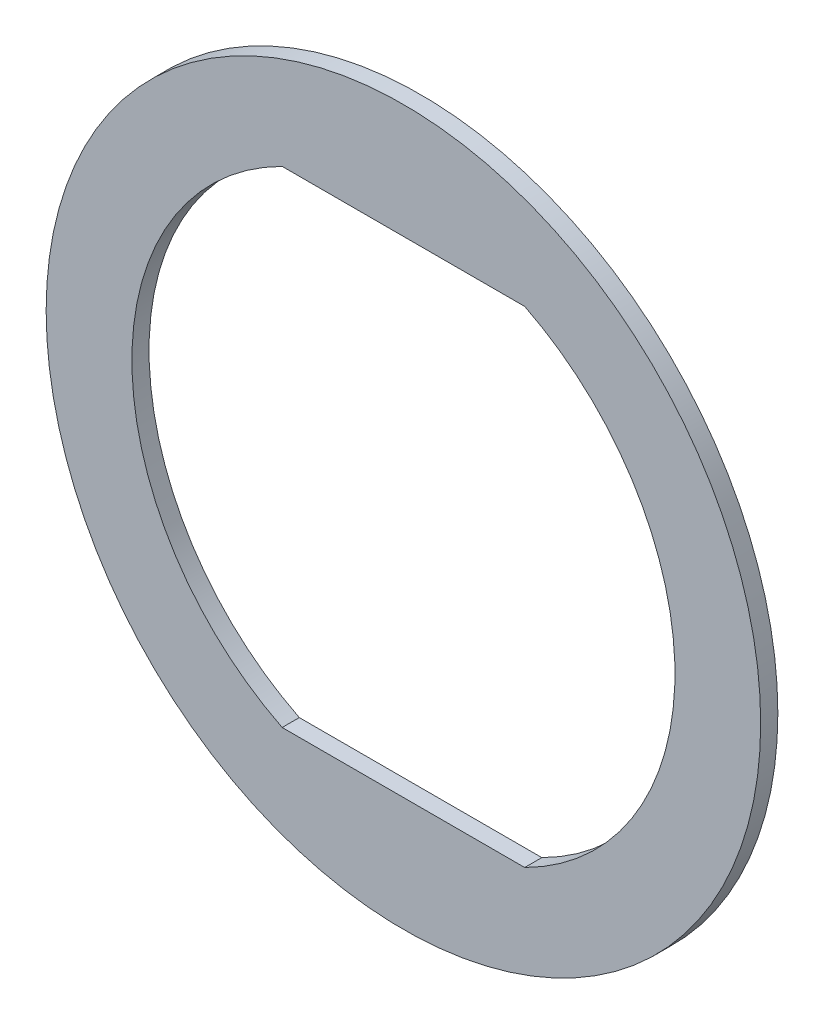
ISO-10303-21;
HEADER;
FILE_DESCRIPTION(('STEP AP214'),'2;1');
FILE_NAME('part.step','',(''),(''),'','','');
FILE_SCHEMA(('AUTOMOTIVE_DESIGN { 1 0 10303 214 1 1 1 1 }'));
ENDSEC;
DATA;
#1=APPLICATION_CONTEXT('core data for automotive mechanical design processes');
#2=APPLICATION_PROTOCOL_DEFINITION('international standard','automotive_design',2000,#1);
#3=PRODUCT_CONTEXT('',#1,'mechanical');
#4=PRODUCT('Part','Part','',(#3));
#5=PRODUCT_RELATED_PRODUCT_CATEGORY('part','',(#4));
#6=PRODUCT_DEFINITION_FORMATION('','',#4);
#7=PRODUCT_DEFINITION_CONTEXT('part definition',#1,'design');
#8=PRODUCT_DEFINITION('design','',#6,#7);
#9=PRODUCT_DEFINITION_SHAPE('','',#8);
#10=(LENGTH_UNIT() NAMED_UNIT(*) SI_UNIT(.MILLI.,.METRE.));
#11=(NAMED_UNIT(*) PLANE_ANGLE_UNIT() SI_UNIT($,.RADIAN.));
#12=(NAMED_UNIT(*) SI_UNIT($,.STERADIAN.) SOLID_ANGLE_UNIT());
#13=UNCERTAINTY_MEASURE_WITH_UNIT(LENGTH_MEASURE(1.E-05),#10,'distance_accuracy_value','');
#14=(GEOMETRIC_REPRESENTATION_CONTEXT(3) GLOBAL_UNCERTAINTY_ASSIGNED_CONTEXT((#13)) GLOBAL_UNIT_ASSIGNED_CONTEXT((#10,
#11,#12)) REPRESENTATION_CONTEXT('',''));
#15=CARTESIAN_POINT('',(0.,0.,0.));
#16=DIRECTION('',(0.,0.,1.));
#17=DIRECTION('',(1.,0.,0.));
#18=AXIS2_PLACEMENT_3D('',#15,#16,#17);
#19=CARTESIAN_POINT('',(0.,0.,0.3));
#20=DIRECTION('',(0.,0.,1.));
#21=DIRECTION('',(1.,0.,0.));
#22=AXIS2_PLACEMENT_3D('',#19,#20,#21);
#23=PLANE('',#22);
#24=CARTESIAN_POINT('',(0.,0.,0.3));
#25=DIRECTION('',(0.,0.,1.));
#26=DIRECTION('',(1.,0.,0.));
#27=AXIS2_PLACEMENT_3D('',#24,#25,#26);
#28=CIRCLE('',#27,12.5);
#29=CARTESIAN_POINT('',(12.5,0.,0.3));
#30=VERTEX_POINT('',#29);
#31=EDGE_CURVE('E11',#30,#30,#28,.T.);
#32=ORIENTED_EDGE('',*,*,#31,.T.);
#33=EDGE_LOOP('',(#32));
#34=FACE_BOUND('',#33,.T.);
#35=DIRECTION('',(1.,0.,0.));
#36=VECTOR('',#35,1.);
#37=CARTESIAN_POINT('',(4.24264068711928,-8.5,0.3));
#38=LINE('',#37,#36);
#39=CARTESIAN_POINT('',(-4.24264068711928,-8.5,0.3));
#40=VERTEX_POINT('',#39);
#41=CARTESIAN_POINT('',(4.24264068711928,-8.5,0.3));
#42=VERTEX_POINT('',#41);
#43=EDGE_CURVE('E82',#40,#42,#38,.T.);
#44=ORIENTED_EDGE('',*,*,#43,.F.);
#45=CARTESIAN_POINT('',(0.,0.,0.3));
#46=DIRECTION('',(0.,0.,1.));
#47=DIRECTION('',(1.,0.,0.));
#48=AXIS2_PLACEMENT_3D('',#45,#46,#47);
#49=CIRCLE('',#48,9.5);
#50=CARTESIAN_POINT('',(-4.24264068711929,8.5,0.3));
#51=VERTEX_POINT('',#50);
#52=EDGE_CURVE('E74',#51,#40,#49,.T.);
#53=ORIENTED_EDGE('',*,*,#52,.F.);
#54=DIRECTION('',(-1.,0.,0.));
#55=VECTOR('',#54,1.);
#56=CARTESIAN_POINT('',(-4.24264068711929,8.5,0.3));
#57=LINE('',#56,#55);
#58=CARTESIAN_POINT('',(4.24264068711928,8.5,0.3));
#59=VERTEX_POINT('',#58);
#60=EDGE_CURVE('E95',#59,#51,#57,.T.);
#61=ORIENTED_EDGE('',*,*,#60,.F.);
#62=CARTESIAN_POINT('',(0.,0.,0.3));
#63=DIRECTION('',(0.,0.,1.));
#64=DIRECTION('',(1.,0.,0.));
#65=AXIS2_PLACEMENT_3D('',#62,#63,#64);
#66=CIRCLE('',#65,9.5);
#67=EDGE_CURVE('E93',#42,#59,#66,.T.);
#68=ORIENTED_EDGE('',*,*,#67,.F.);
#69=EDGE_LOOP('',(#44,#53,#61,#68));
#70=FACE_BOUND('',#69,.T.);
#71=ADVANCED_FACE('F33',(#34,#70),#23,.T.);
#72=CARTESIAN_POINT('',(0.,0.,-0.3));
#73=DIRECTION('',(0.,0.,1.));
#74=DIRECTION('',(1.,0.,0.));
#75=AXIS2_PLACEMENT_3D('',#72,#73,#74);
#76=PLANE('',#75);
#77=CARTESIAN_POINT('',(0.,0.,-0.3));
#78=DIRECTION('',(0.,0.,1.));
#79=DIRECTION('',(1.,0.,0.));
#80=AXIS2_PLACEMENT_3D('',#77,#78,#79);
#81=CIRCLE('',#80,12.5);
#82=CARTESIAN_POINT('',(12.5,0.,-0.3));
#83=VERTEX_POINT('',#82);
#84=EDGE_CURVE('E37',#83,#83,#81,.T.);
#85=ORIENTED_EDGE('',*,*,#84,.F.);
#86=EDGE_LOOP('',(#85));
#87=FACE_BOUND('',#86,.T.);
#88=CARTESIAN_POINT('',(0.,0.,-0.3));
#89=DIRECTION('',(0.,0.,1.));
#90=DIRECTION('',(1.,0.,0.));
#91=AXIS2_PLACEMENT_3D('',#88,#89,#90);
#92=CIRCLE('',#91,9.5);
#93=CARTESIAN_POINT('',(-4.24264068711929,8.5,-0.3));
#94=VERTEX_POINT('',#93);
#95=CARTESIAN_POINT('',(-4.24264068711928,-8.5,-0.3));
#96=VERTEX_POINT('',#95);
#97=EDGE_CURVE('E56',#94,#96,#92,.T.);
#98=ORIENTED_EDGE('',*,*,#97,.T.);
#99=DIRECTION('',(1.,0.,0.));
#100=VECTOR('',#99,1.);
#101=CARTESIAN_POINT('',(4.24264068711928,-8.5,-0.3));
#102=LINE('',#101,#100);
#103=CARTESIAN_POINT('',(4.24264068711928,-8.5,-0.3));
#104=VERTEX_POINT('',#103);
#105=EDGE_CURVE('E89',#96,#104,#102,.T.);
#106=ORIENTED_EDGE('',*,*,#105,.T.);
#107=CARTESIAN_POINT('',(0.,0.,-0.3));
#108=DIRECTION('',(0.,0.,1.));
#109=DIRECTION('',(1.,0.,0.));
#110=AXIS2_PLACEMENT_3D('',#107,#108,#109);
#111=CIRCLE('',#110,9.5);
#112=CARTESIAN_POINT('',(4.24264068711928,8.5,-0.3));
#113=VERTEX_POINT('',#112);
#114=EDGE_CURVE('E101',#104,#113,#111,.T.);
#115=ORIENTED_EDGE('',*,*,#114,.T.);
#116=DIRECTION('',(-1.,0.,0.));
#117=VECTOR('',#116,1.);
#118=CARTESIAN_POINT('',(-4.24264068711929,8.5,-0.3));
#119=LINE('',#118,#117);
#120=EDGE_CURVE('E83',#113,#94,#119,.T.);
#121=ORIENTED_EDGE('',*,*,#120,.T.);
#122=EDGE_LOOP('',(#98,#106,#115,#121));
#123=FACE_BOUND('',#122,.T.);
#124=ADVANCED_FACE('F112',(#87,#123),#76,.F.);
#125=CARTESIAN_POINT('',(0.,0.,0.3));
#126=DIRECTION('',(0.,0.,-1.));
#127=DIRECTION('',(-1.,0.,0.));
#128=AXIS2_PLACEMENT_3D('',#125,#126,#127);
#129=CYLINDRICAL_SURFACE('',#128,12.5);
#130=ORIENTED_EDGE('',*,*,#31,.F.);
#131=EDGE_LOOP('',(#130));
#132=FACE_BOUND('',#131,.T.);
#133=ORIENTED_EDGE('',*,*,#84,.T.);
#134=EDGE_LOOP('',(#133));
#135=FACE_BOUND('',#134,.T.);
#136=ADVANCED_FACE('F35',(#132,#135),#129,.T.);
#137=CARTESIAN_POINT('',(0.,0.,0.3));
#138=DIRECTION('',(0.,0.,-1.));
#139=DIRECTION('',(-1.,0.,0.));
#140=AXIS2_PLACEMENT_3D('',#137,#138,#139);
#141=CYLINDRICAL_SURFACE('',#140,9.5);
#142=ORIENTED_EDGE('',*,*,#97,.F.);
#143=DIRECTION('',(0.,0.,-1.));
#144=VECTOR('',#143,1.);
#145=CARTESIAN_POINT('',(-4.24264068711929,8.5,0.3));
#146=LINE('',#145,#144);
#147=EDGE_CURVE('E78',#51,#94,#146,.T.);
#148=ORIENTED_EDGE('',*,*,#147,.F.);
#149=ORIENTED_EDGE('',*,*,#52,.T.);
#150=DIRECTION('',(0.,0.,-1.));
#151=VECTOR('',#150,1.);
#152=CARTESIAN_POINT('',(-4.24264068711928,-8.5,0.3));
#153=LINE('',#152,#151);
#154=EDGE_CURVE('E77',#40,#96,#153,.T.);
#155=ORIENTED_EDGE('',*,*,#154,.T.);
#156=EDGE_LOOP('',(#142,#148,#149,#155));
#157=FACE_BOUND('',#156,.T.);
#158=ADVANCED_FACE('F76',(#157),#141,.F.);
#159=CARTESIAN_POINT('',(4.24264068711928,-8.5,0.3));
#160=DIRECTION('',(0.,1.,0.));
#161=DIRECTION('',(0.,0.,1.));
#162=AXIS2_PLACEMENT_3D('',#159,#160,#161);
#163=PLANE('',#162);
#164=ORIENTED_EDGE('',*,*,#105,.F.);
#165=ORIENTED_EDGE('',*,*,#154,.F.);
#166=ORIENTED_EDGE('',*,*,#43,.T.);
#167=DIRECTION('',(0.,0.,-1.));
#168=VECTOR('',#167,1.);
#169=CARTESIAN_POINT('',(4.24264068711928,-8.5,0.3));
#170=LINE('',#169,#168);
#171=EDGE_CURVE('E90',#42,#104,#170,.T.);
#172=ORIENTED_EDGE('',*,*,#171,.T.);
#173=EDGE_LOOP('',(#164,#165,#166,#172));
#174=FACE_BOUND('',#173,.T.);
#175=ADVANCED_FACE('F86',(#174),#163,.T.);
#176=CARTESIAN_POINT('',(0.,0.,0.3));
#177=DIRECTION('',(0.,0.,-1.));
#178=DIRECTION('',(-1.,0.,0.));
#179=AXIS2_PLACEMENT_3D('',#176,#177,#178);
#180=CYLINDRICAL_SURFACE('',#179,9.5);
#181=ORIENTED_EDGE('',*,*,#114,.F.);
#182=ORIENTED_EDGE('',*,*,#171,.F.);
#183=ORIENTED_EDGE('',*,*,#67,.T.);
#184=DIRECTION('',(0.,0.,-1.));
#185=VECTOR('',#184,1.);
#186=CARTESIAN_POINT('',(4.24264068711928,8.5,0.3));
#187=LINE('',#186,#185);
#188=EDGE_CURVE('E48',#59,#113,#187,.T.);
#189=ORIENTED_EDGE('',*,*,#188,.T.);
#190=EDGE_LOOP('',(#181,#182,#183,#189));
#191=FACE_BOUND('',#190,.T.);
#192=ADVANCED_FACE('F110',(#191),#180,.F.);
#193=CARTESIAN_POINT('',(-4.24264068711929,8.5,0.3));
#194=DIRECTION('',(0.,-1.,0.));
#195=DIRECTION('',(1.,0.,0.));
#196=AXIS2_PLACEMENT_3D('',#193,#194,#195);
#197=PLANE('',#196);
#198=ORIENTED_EDGE('',*,*,#120,.F.);
#199=ORIENTED_EDGE('',*,*,#188,.F.);
#200=ORIENTED_EDGE('',*,*,#60,.T.);
#201=ORIENTED_EDGE('',*,*,#147,.T.);
#202=EDGE_LOOP('',(#198,#199,#200,#201));
#203=FACE_BOUND('',#202,.T.);
#204=ADVANCED_FACE('F113',(#203),#197,.T.);
#205=CLOSED_SHELL('',(#71,#124,#136,#158,#175,#192,#204));
#206=MANIFOLD_SOLID_BREP('B2',#205);
#207=ADVANCED_BREP_SHAPE_REPRESENTATION('',(#18,#206),#14);
#208=SHAPE_DEFINITION_REPRESENTATION(#9,#207);
ENDSEC;
END-ISO-10303-21;
